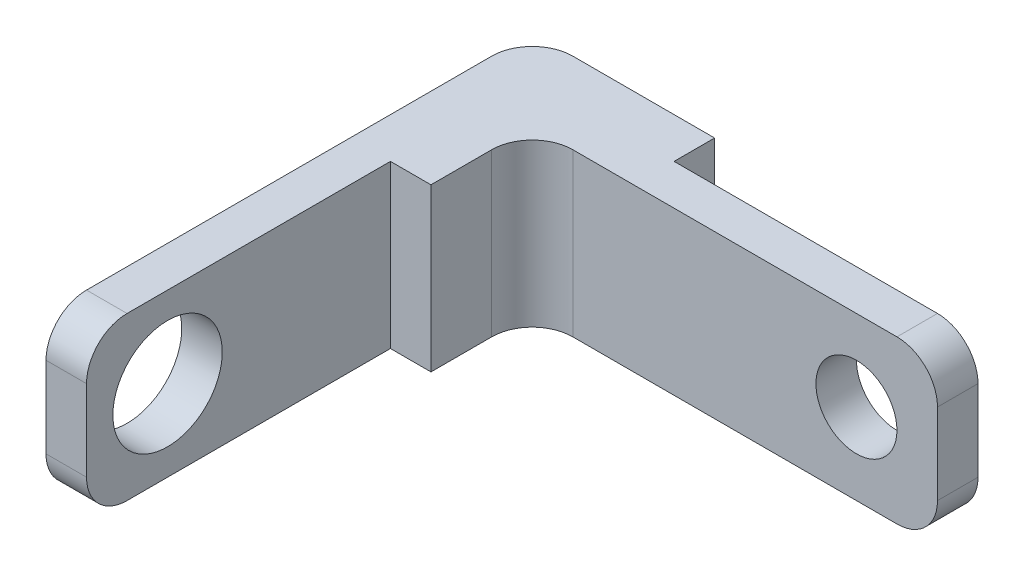
ISO-10303-21;
HEADER;
FILE_DESCRIPTION(('STEP AP214'),'2;1');
FILE_NAME('part.step','',(''),(''),'','','');
FILE_SCHEMA(('AUTOMOTIVE_DESIGN { 1 0 10303 214 1 1 1 1 }'));
ENDSEC;
DATA;
#1=APPLICATION_CONTEXT('core data for automotive mechanical design processes');
#2=APPLICATION_PROTOCOL_DEFINITION('international standard','automotive_design',2000,#1);
#3=PRODUCT_CONTEXT('',#1,'mechanical');
#4=PRODUCT('Part','Part','',(#3));
#5=PRODUCT_RELATED_PRODUCT_CATEGORY('part','',(#4));
#6=PRODUCT_DEFINITION_FORMATION('','',#4);
#7=PRODUCT_DEFINITION_CONTEXT('part definition',#1,'design');
#8=PRODUCT_DEFINITION('design','',#6,#7);
#9=PRODUCT_DEFINITION_SHAPE('','',#8);
#10=(LENGTH_UNIT() NAMED_UNIT(*) SI_UNIT(.MILLI.,.METRE.));
#11=(NAMED_UNIT(*) PLANE_ANGLE_UNIT() SI_UNIT($,.RADIAN.));
#12=(NAMED_UNIT(*) SI_UNIT($,.STERADIAN.) SOLID_ANGLE_UNIT());
#13=UNCERTAINTY_MEASURE_WITH_UNIT(LENGTH_MEASURE(1.E-05),#10,'distance_accuracy_value','');
#14=(GEOMETRIC_REPRESENTATION_CONTEXT(3) GLOBAL_UNCERTAINTY_ASSIGNED_CONTEXT((#13)) GLOBAL_UNIT_ASSIGNED_CONTEXT((#10,
#11,#12)) REPRESENTATION_CONTEXT('',''));
#15=CARTESIAN_POINT('',(0.,0.,0.));
#16=DIRECTION('',(0.,0.,1.));
#17=DIRECTION('',(1.,0.,0.));
#18=AXIS2_PLACEMENT_3D('',#15,#16,#17);
#19=CARTESIAN_POINT('',(0.,0.,120.));
#20=DIRECTION('',(0.,0.,1.));
#21=DIRECTION('',(1.,0.,0.));
#22=AXIS2_PLACEMENT_3D('',#19,#20,#21);
#23=PLANE('',#22);
#24=DIRECTION('',(0.,-1.,0.));
#25=VECTOR('',#24,1.);
#26=CARTESIAN_POINT('',(-60.,20.,120.));
#27=LINE('',#26,#25);
#28=CARTESIAN_POINT('',(-60.,10.,120.));
#29=VERTEX_POINT('',#28);
#30=CARTESIAN_POINT('',(-60.,-10.,120.));
#31=VERTEX_POINT('',#30);
#32=EDGE_CURVE('E192',#29,#31,#27,.T.);
#33=ORIENTED_EDGE('',*,*,#32,.T.);
#34=DIRECTION('',(1.,0.,0.));
#35=VECTOR('',#34,1.);
#36=CARTESIAN_POINT('',(-50.,-10.,120.));
#37=LINE('',#36,#35);
#38=CARTESIAN_POINT('',(-50.,-10.,120.));
#39=VERTEX_POINT('',#38);
#40=EDGE_CURVE('E244',#31,#39,#37,.T.);
#41=ORIENTED_EDGE('',*,*,#40,.T.);
#42=DIRECTION('',(0.,-1.,0.));
#43=VECTOR('',#42,1.);
#44=CARTESIAN_POINT('',(-50.,20.,120.));
#45=LINE('',#44,#43);
#46=CARTESIAN_POINT('',(-50.,10.,120.));
#47=VERTEX_POINT('',#46);
#48=EDGE_CURVE('E155',#47,#39,#45,.T.);
#49=ORIENTED_EDGE('',*,*,#48,.F.);
#50=DIRECTION('',(-1.,0.,0.));
#51=VECTOR('',#50,1.);
#52=CARTESIAN_POINT('',(-60.,10.,120.));
#53=LINE('',#52,#51);
#54=EDGE_CURVE('E241',#47,#29,#53,.T.);
#55=ORIENTED_EDGE('',*,*,#54,.T.);
#56=EDGE_LOOP('',(#33,#41,#49,#55));
#57=FACE_BOUND('',#56,.T.);
#58=ADVANCED_FACE('F32',(#57),#23,.T.);
#59=CARTESIAN_POINT('',(60.,20.,20.));
#60=DIRECTION('',(-1.,0.,0.));
#61=DIRECTION('',(0.,0.,1.));
#62=AXIS2_PLACEMENT_3D('',#59,#60,#61);
#63=PLANE('',#62);
#64=DIRECTION('',(0.,-1.,0.));
#65=VECTOR('',#64,1.);
#66=CARTESIAN_POINT('',(60.,20.,10.));
#67=LINE('',#66,#65);
#68=CARTESIAN_POINT('',(60.,10.,10.));
#69=VERTEX_POINT('',#68);
#70=CARTESIAN_POINT('',(60.,-10.,10.));
#71=VERTEX_POINT('',#70);
#72=EDGE_CURVE('E176',#69,#71,#67,.T.);
#73=ORIENTED_EDGE('',*,*,#72,.F.);
#74=DIRECTION('',(0.,0.,-1.));
#75=VECTOR('',#74,1.);
#76=CARTESIAN_POINT('',(60.,10.,20.));
#77=LINE('',#76,#75);
#78=CARTESIAN_POINT('',(60.,10.,20.));
#79=VERTEX_POINT('',#78);
#80=EDGE_CURVE('E228',#69,#79,#77,.F.);
#81=ORIENTED_EDGE('',*,*,#80,.T.);
#82=DIRECTION('',(0.,1.,0.));
#83=VECTOR('',#82,1.);
#84=CARTESIAN_POINT('',(60.,20.,20.));
#85=LINE('',#84,#83);
#86=CARTESIAN_POINT('',(60.,-10.,20.));
#87=VERTEX_POINT('',#86);
#88=EDGE_CURVE('E198',#87,#79,#85,.T.);
#89=ORIENTED_EDGE('',*,*,#88,.F.);
#90=DIRECTION('',(0.,0.,-1.));
#91=VECTOR('',#90,1.);
#92=CARTESIAN_POINT('',(60.,-10.,20.));
#93=LINE('',#92,#91);
#94=EDGE_CURVE('E225',#87,#71,#93,.T.);
#95=ORIENTED_EDGE('',*,*,#94,.T.);
#96=EDGE_LOOP('',(#73,#81,#89,#95));
#97=FACE_BOUND('',#96,.T.);
#98=ADVANCED_FACE('F345',(#97),#63,.F.);
#99=CARTESIAN_POINT('',(-60.,20.,20.));
#100=DIRECTION('',(0.,-1.,0.));
#101=DIRECTION('',(0.,0.,-1.));
#102=AXIS2_PLACEMENT_3D('',#99,#100,#101);
#103=PLANE('',#102);
#104=DIRECTION('',(-1.,0.,0.));
#105=VECTOR('',#104,1.);
#106=CARTESIAN_POINT('',(-60.,20.,20.));
#107=LINE('',#106,#105);
#108=CARTESIAN_POINT('',(50.,20.,20.));
#109=VERTEX_POINT('',#108);
#110=CARTESIAN_POINT('',(-30.,20.,20.));
#111=VERTEX_POINT('',#110);
#112=EDGE_CURVE('E201',#109,#111,#107,.T.);
#113=ORIENTED_EDGE('',*,*,#112,.F.);
#114=DIRECTION('',(0.,0.,-1.));
#115=VECTOR('',#114,1.);
#116=CARTESIAN_POINT('',(50.,20.,20.));
#117=LINE('',#116,#115);
#118=CARTESIAN_POINT('',(50.,20.,10.));
#119=VERTEX_POINT('',#118);
#120=EDGE_CURVE('E218',#109,#119,#117,.T.);
#121=ORIENTED_EDGE('',*,*,#120,.T.);
#122=DIRECTION('',(1.,0.,0.));
#123=VECTOR('',#122,1.);
#124=CARTESIAN_POINT('',(60.,20.,10.));
#125=LINE('',#124,#123);
#126=CARTESIAN_POINT('',(-15.,20.,10.));
#127=VERTEX_POINT('',#126);
#128=EDGE_CURVE('E184',#127,#119,#125,.T.);
#129=ORIENTED_EDGE('',*,*,#128,.F.);
#130=DIRECTION('',(0.,0.,-1.));
#131=VECTOR('',#130,1.);
#132=CARTESIAN_POINT('',(-15.,20.,10.));
#133=LINE('',#132,#131);
#134=CARTESIAN_POINT('',(-15.,20.,0.));
#135=VERTEX_POINT('',#134);
#136=EDGE_CURVE('E189',#127,#135,#133,.T.);
#137=ORIENTED_EDGE('',*,*,#136,.T.);
#138=DIRECTION('',(-1.,0.,0.));
#139=VECTOR('',#138,1.);
#140=CARTESIAN_POINT('',(-60.,20.,0.));
#141=LINE('',#140,#139);
#142=CARTESIAN_POINT('',(-50.,20.,0.));
#143=VERTEX_POINT('',#142);
#144=EDGE_CURVE('E274',#135,#143,#141,.T.);
#145=ORIENTED_EDGE('',*,*,#144,.T.);
#146=CARTESIAN_POINT('',(-50.,20.,10.));
#147=DIRECTION('',(0.,-1.,0.));
#148=DIRECTION('',(0.,0.,-1.));
#149=AXIS2_PLACEMENT_3D('',#146,#147,#148);
#150=CIRCLE('',#149,10.);
#151=CARTESIAN_POINT('',(-60.,20.,10.));
#152=VERTEX_POINT('',#151);
#153=EDGE_CURVE('E213',#143,#152,#150,.F.);
#154=ORIENTED_EDGE('',*,*,#153,.T.);
#155=DIRECTION('',(0.,0.,-1.));
#156=VECTOR('',#155,1.);
#157=CARTESIAN_POINT('',(-60.,20.,20.));
#158=LINE('',#157,#156);
#159=CARTESIAN_POINT('',(-60.,20.,110.));
#160=VERTEX_POINT('',#159);
#161=EDGE_CURVE('E216',#160,#152,#158,.T.);
#162=ORIENTED_EDGE('',*,*,#161,.F.);
#163=DIRECTION('',(-1.,0.,0.));
#164=VECTOR('',#163,1.);
#165=CARTESIAN_POINT('',(-50.,20.,110.));
#166=LINE('',#165,#164);
#167=CARTESIAN_POINT('',(-50.,20.,110.));
#168=VERTEX_POINT('',#167);
#169=EDGE_CURVE('E215',#160,#168,#166,.F.);
#170=ORIENTED_EDGE('',*,*,#169,.T.);
#171=DIRECTION('',(0.,0.,1.));
#172=VECTOR('',#171,1.);
#173=CARTESIAN_POINT('',(-50.,20.,120.));
#174=LINE('',#173,#172);
#175=CARTESIAN_POINT('',(-50.,20.,45.));
#176=VERTEX_POINT('',#175);
#177=EDGE_CURVE('E163',#176,#168,#174,.T.);
#178=ORIENTED_EDGE('',*,*,#177,.F.);
#179=DIRECTION('',(1.,0.,0.));
#180=VECTOR('',#179,1.);
#181=CARTESIAN_POINT('',(-50.,20.,45.));
#182=LINE('',#181,#180);
#183=CARTESIAN_POINT('',(-40.,20.,45.));
#184=VERTEX_POINT('',#183);
#185=EDGE_CURVE('E162',#176,#184,#182,.T.);
#186=ORIENTED_EDGE('',*,*,#185,.T.);
#187=DIRECTION('',(0.,0.,-1.));
#188=VECTOR('',#187,1.);
#189=CARTESIAN_POINT('',(-40.,20.,120.));
#190=LINE('',#189,#188);
#191=CARTESIAN_POINT('',(-40.,20.,30.));
#192=VERTEX_POINT('',#191);
#193=EDGE_CURVE('E197',#184,#192,#190,.T.);
#194=ORIENTED_EDGE('',*,*,#193,.T.);
#195=CARTESIAN_POINT('',(-30.,20.,30.));
#196=DIRECTION('',(0.,-1.,0.));
#197=DIRECTION('',(0.,0.,-1.));
#198=AXIS2_PLACEMENT_3D('',#195,#196,#197);
#199=CIRCLE('',#198,10.);
#200=EDGE_CURVE('E40',#192,#111,#199,.T.);
#201=ORIENTED_EDGE('',*,*,#200,.T.);
#202=EDGE_LOOP('',(#113,#121,#129,#137,#145,#154,#162,#170,#178,#186,#194,#201));
#203=FACE_BOUND('',#202,.T.);
#204=ADVANCED_FACE('F293',(#203),#103,.F.);
#205=CARTESIAN_POINT('',(-60.,20.,20.));
#206=DIRECTION('',(1.,0.,0.));
#207=DIRECTION('',(0.,1.,0.));
#208=AXIS2_PLACEMENT_3D('',#205,#206,#207);
#209=PLANE('',#208);
#210=CARTESIAN_POINT('',(-60.,0.,100.));
#211=DIRECTION('',(1.,0.,0.));
#212=DIRECTION('',(0.,1.,0.));
#213=AXIS2_PLACEMENT_3D('',#210,#211,#212);
#214=CIRCLE('',#213,13.5);
#215=CARTESIAN_POINT('',(-60.,13.5,100.));
#216=VERTEX_POINT('',#215);
#217=EDGE_CURVE('E307',#216,#216,#214,.F.);
#218=ORIENTED_EDGE('',*,*,#217,.F.);
#219=EDGE_LOOP('',(#218));
#220=FACE_BOUND('',#219,.T.);
#221=DIRECTION('',(0.,0.,-1.));
#222=VECTOR('',#221,1.);
#223=CARTESIAN_POINT('',(-60.,-20.,20.));
#224=LINE('',#223,#222);
#225=CARTESIAN_POINT('',(-60.,-20.,110.));
#226=VERTEX_POINT('',#225);
#227=CARTESIAN_POINT('',(-60.,-20.,10.));
#228=VERTEX_POINT('',#227);
#229=EDGE_CURVE('E263',#226,#228,#224,.T.);
#230=ORIENTED_EDGE('',*,*,#229,.F.);
#231=CARTESIAN_POINT('',(-60.,-10.,110.));
#232=DIRECTION('',(1.,0.,0.));
#233=DIRECTION('',(0.,1.,0.));
#234=AXIS2_PLACEMENT_3D('',#231,#232,#233);
#235=CIRCLE('',#234,10.);
#236=EDGE_CURVE('E255',#226,#31,#235,.F.);
#237=ORIENTED_EDGE('',*,*,#236,.T.);
#238=ORIENTED_EDGE('',*,*,#32,.F.);
#239=CARTESIAN_POINT('',(-60.,10.,110.));
#240=DIRECTION('',(1.,0.,0.));
#241=DIRECTION('',(0.,1.,0.));
#242=AXIS2_PLACEMENT_3D('',#239,#240,#241);
#243=CIRCLE('',#242,10.);
#244=EDGE_CURVE('E253',#29,#160,#243,.F.);
#245=ORIENTED_EDGE('',*,*,#244,.T.);
#246=ORIENTED_EDGE('',*,*,#161,.T.);
#247=DIRECTION('',(0.,-1.,0.));
#248=VECTOR('',#247,1.);
#249=CARTESIAN_POINT('',(-60.,20.,10.));
#250=LINE('',#249,#248);
#251=EDGE_CURVE('E250',#152,#228,#250,.T.);
#252=ORIENTED_EDGE('',*,*,#251,.T.);
#253=EDGE_LOOP('',(#230,#237,#238,#245,#246,#252));
#254=FACE_BOUND('',#253,.T.);
#255=ADVANCED_FACE('F296',(#220,#254),#209,.F.);
#256=CARTESIAN_POINT('',(-60.,-20.,20.));
#257=DIRECTION('',(0.,1.,0.));
#258=DIRECTION('',(0.,0.,1.));
#259=AXIS2_PLACEMENT_3D('',#256,#257,#258);
#260=PLANE('',#259);
#261=DIRECTION('',(-1.,0.,0.));
#262=VECTOR('',#261,1.);
#263=CARTESIAN_POINT('',(60.,-20.,10.));
#264=LINE('',#263,#262);
#265=CARTESIAN_POINT('',(50.,-20.,10.));
#266=VERTEX_POINT('',#265);
#267=CARTESIAN_POINT('',(-15.,-20.,10.));
#268=VERTEX_POINT('',#267);
#269=EDGE_CURVE('E179',#266,#268,#264,.T.);
#270=ORIENTED_EDGE('',*,*,#269,.F.);
#271=DIRECTION('',(0.,0.,-1.));
#272=VECTOR('',#271,1.);
#273=CARTESIAN_POINT('',(50.,-20.,20.));
#274=LINE('',#273,#272);
#275=CARTESIAN_POINT('',(50.,-20.,20.));
#276=VERTEX_POINT('',#275);
#277=EDGE_CURVE('E238',#266,#276,#274,.F.);
#278=ORIENTED_EDGE('',*,*,#277,.T.);
#279=DIRECTION('',(1.,0.,0.));
#280=VECTOR('',#279,1.);
#281=CARTESIAN_POINT('',(-60.,-20.,20.));
#282=LINE('',#281,#280);
#283=CARTESIAN_POINT('',(-30.,-20.,20.));
#284=VERTEX_POINT('',#283);
#285=EDGE_CURVE('E210',#284,#276,#282,.T.);
#286=ORIENTED_EDGE('',*,*,#285,.F.);
#287=CARTESIAN_POINT('',(-30.,-20.,30.));
#288=DIRECTION('',(0.,1.,0.));
#289=DIRECTION('',(0.,0.,1.));
#290=AXIS2_PLACEMENT_3D('',#287,#288,#289);
#291=CIRCLE('',#290,10.);
#292=CARTESIAN_POINT('',(-40.,-20.,30.));
#293=VERTEX_POINT('',#292);
#294=EDGE_CURVE('E11',#284,#293,#291,.T.);
#295=ORIENTED_EDGE('',*,*,#294,.T.);
#296=DIRECTION('',(0.,0.,-1.));
#297=VECTOR('',#296,1.);
#298=CARTESIAN_POINT('',(-40.,-20.,120.));
#299=LINE('',#298,#297);
#300=CARTESIAN_POINT('',(-40.,-20.,45.));
#301=VERTEX_POINT('',#300);
#302=EDGE_CURVE('E169',#301,#293,#299,.T.);
#303=ORIENTED_EDGE('',*,*,#302,.F.);
#304=DIRECTION('',(1.,0.,0.));
#305=VECTOR('',#304,1.);
#306=CARTESIAN_POINT('',(-50.,-20.,45.));
#307=LINE('',#306,#305);
#308=CARTESIAN_POINT('',(-50.,-20.,45.));
#309=VERTEX_POINT('',#308);
#310=EDGE_CURVE('E159',#309,#301,#307,.T.);
#311=ORIENTED_EDGE('',*,*,#310,.F.);
#312=DIRECTION('',(0.,0.,-1.));
#313=VECTOR('',#312,1.);
#314=CARTESIAN_POINT('',(-50.,-20.,120.));
#315=LINE('',#314,#313);
#316=CARTESIAN_POINT('',(-50.,-20.,110.));
#317=VERTEX_POINT('',#316);
#318=EDGE_CURVE('E144',#317,#309,#315,.T.);
#319=ORIENTED_EDGE('',*,*,#318,.F.);
#320=DIRECTION('',(1.,0.,0.));
#321=VECTOR('',#320,1.);
#322=CARTESIAN_POINT('',(-60.,-20.,110.));
#323=LINE('',#322,#321);
#324=EDGE_CURVE('E236',#317,#226,#323,.F.);
#325=ORIENTED_EDGE('',*,*,#324,.T.);
#326=ORIENTED_EDGE('',*,*,#229,.T.);
#327=CARTESIAN_POINT('',(-50.,-20.,10.));
#328=DIRECTION('',(0.,1.,0.));
#329=DIRECTION('',(0.,0.,1.));
#330=AXIS2_PLACEMENT_3D('',#327,#328,#329);
#331=CIRCLE('',#330,10.);
#332=CARTESIAN_POINT('',(-50.,-20.,0.));
#333=VERTEX_POINT('',#332);
#334=EDGE_CURVE('E234',#228,#333,#331,.F.);
#335=ORIENTED_EDGE('',*,*,#334,.T.);
#336=DIRECTION('',(1.,0.,0.));
#337=VECTOR('',#336,1.);
#338=CARTESIAN_POINT('',(-60.,-20.,0.));
#339=LINE('',#338,#337);
#340=CARTESIAN_POINT('',(-15.,-20.,0.));
#341=VERTEX_POINT('',#340);
#342=EDGE_CURVE('E202',#333,#341,#339,.T.);
#343=ORIENTED_EDGE('',*,*,#342,.T.);
#344=DIRECTION('',(0.,0.,-1.));
#345=VECTOR('',#344,1.);
#346=CARTESIAN_POINT('',(-15.,-20.,10.));
#347=LINE('',#346,#345);
#348=EDGE_CURVE('E187',#268,#341,#347,.T.);
#349=ORIENTED_EDGE('',*,*,#348,.F.);
#350=EDGE_LOOP('',(#270,#278,#286,#295,#303,#311,#319,#325,#326,#335,#343,#349));
#351=FACE_BOUND('',#350,.T.);
#352=ADVANCED_FACE('F167',(#351),#260,.F.);
#353=CARTESIAN_POINT('',(0.,0.,20.));
#354=DIRECTION('',(0.,0.,1.));
#355=DIRECTION('',(1.,0.,0.));
#356=AXIS2_PLACEMENT_3D('',#353,#354,#355);
#357=PLANE('',#356);
#358=CARTESIAN_POINT('',(40.,0.,20.));
#359=DIRECTION('',(0.,0.,1.));
#360=DIRECTION('',(1.,0.,0.));
#361=AXIS2_PLACEMENT_3D('',#358,#359,#360);
#362=CIRCLE('',#361,9.99999999999999);
#363=CARTESIAN_POINT('',(50.,0.,20.));
#364=VERTEX_POINT('',#363);
#365=EDGE_CURVE('E315',#364,#364,#362,.T.);
#366=ORIENTED_EDGE('',*,*,#365,.F.);
#367=EDGE_LOOP('',(#366));
#368=FACE_BOUND('',#367,.T.);
#369=ORIENTED_EDGE('',*,*,#112,.T.);
#370=DIRECTION('',(0.,1.,0.));
#371=VECTOR('',#370,1.);
#372=CARTESIAN_POINT('',(-30.,0.,20.));
#373=LINE('',#372,#371);
#374=EDGE_CURVE('E47',#111,#284,#373,.F.);
#375=ORIENTED_EDGE('',*,*,#374,.T.);
#376=ORIENTED_EDGE('',*,*,#285,.T.);
#377=CARTESIAN_POINT('',(50.,-10.,20.));
#378=DIRECTION('',(0.,0.,1.));
#379=DIRECTION('',(1.,0.,0.));
#380=AXIS2_PLACEMENT_3D('',#377,#378,#379);
#381=CIRCLE('',#380,10.);
#382=EDGE_CURVE('E230',#276,#87,#381,.T.);
#383=ORIENTED_EDGE('',*,*,#382,.T.);
#384=ORIENTED_EDGE('',*,*,#88,.T.);
#385=CARTESIAN_POINT('',(50.,10.,20.));
#386=DIRECTION('',(0.,0.,1.));
#387=DIRECTION('',(1.,0.,0.));
#388=AXIS2_PLACEMENT_3D('',#385,#386,#387);
#389=CIRCLE('',#388,10.);
#390=EDGE_CURVE('E232',#79,#109,#389,.T.);
#391=ORIENTED_EDGE('',*,*,#390,.T.);
#392=EDGE_LOOP('',(#369,#375,#376,#383,#384,#391));
#393=FACE_BOUND('',#392,.T.);
#394=ADVANCED_FACE('F330',(#368,#393),#357,.T.);
#395=CARTESIAN_POINT('',(0.,0.,0.));
#396=DIRECTION('',(0.,0.,1.));
#397=DIRECTION('',(1.,0.,0.));
#398=AXIS2_PLACEMENT_3D('',#395,#396,#397);
#399=PLANE('',#398);
#400=ORIENTED_EDGE('',*,*,#342,.F.);
#401=DIRECTION('',(0.,-1.,0.));
#402=VECTOR('',#401,1.);
#403=CARTESIAN_POINT('',(-50.,0.,0.));
#404=LINE('',#403,#402);
#405=EDGE_CURVE('E257',#333,#143,#404,.F.);
#406=ORIENTED_EDGE('',*,*,#405,.T.);
#407=ORIENTED_EDGE('',*,*,#144,.F.);
#408=DIRECTION('',(0.,1.,0.));
#409=VECTOR('',#408,1.);
#410=CARTESIAN_POINT('',(-15.,20.,0.));
#411=LINE('',#410,#409);
#412=EDGE_CURVE('E171',#341,#135,#411,.T.);
#413=ORIENTED_EDGE('',*,*,#412,.F.);
#414=EDGE_LOOP('',(#400,#406,#407,#413));
#415=FACE_BOUND('',#414,.T.);
#416=ADVANCED_FACE('F288',(#415),#399,.F.);
#417=CARTESIAN_POINT('',(-40.,20.,120.));
#418=DIRECTION('',(-1.,0.,0.));
#419=DIRECTION('',(0.,0.,1.));
#420=AXIS2_PLACEMENT_3D('',#417,#418,#419);
#421=PLANE('',#420);
#422=ORIENTED_EDGE('',*,*,#302,.T.);
#423=DIRECTION('',(0.,1.,0.));
#424=VECTOR('',#423,1.);
#425=CARTESIAN_POINT('',(-40.,20.,30.));
#426=LINE('',#425,#424);
#427=EDGE_CURVE('E259',#293,#192,#426,.T.);
#428=ORIENTED_EDGE('',*,*,#427,.T.);
#429=ORIENTED_EDGE('',*,*,#193,.F.);
#430=DIRECTION('',(0.,1.,0.));
#431=VECTOR('',#430,1.);
#432=CARTESIAN_POINT('',(-40.,20.,45.));
#433=LINE('',#432,#431);
#434=EDGE_CURVE('E305',#301,#184,#433,.T.);
#435=ORIENTED_EDGE('',*,*,#434,.F.);
#436=EDGE_LOOP('',(#422,#428,#429,#435));
#437=FACE_BOUND('',#436,.T.);
#438=ADVANCED_FACE('F357',(#437),#421,.F.);
#439=CARTESIAN_POINT('',(-15.,20.,10.));
#440=DIRECTION('',(-1.,0.,0.));
#441=DIRECTION('',(0.,-1.,0.));
#442=AXIS2_PLACEMENT_3D('',#439,#440,#441);
#443=PLANE('',#442);
#444=ORIENTED_EDGE('',*,*,#412,.T.);
#445=ORIENTED_EDGE('',*,*,#136,.F.);
#446=DIRECTION('',(0.,1.,0.));
#447=VECTOR('',#446,1.);
#448=CARTESIAN_POINT('',(-15.,20.,10.));
#449=LINE('',#448,#447);
#450=EDGE_CURVE('E181',#268,#127,#449,.T.);
#451=ORIENTED_EDGE('',*,*,#450,.F.);
#452=ORIENTED_EDGE('',*,*,#348,.T.);
#453=EDGE_LOOP('',(#444,#445,#451,#452));
#454=FACE_BOUND('',#453,.T.);
#455=ADVANCED_FACE('F287',(#454),#443,.F.);
#456=CARTESIAN_POINT('',(0.,0.,10.));
#457=DIRECTION('',(0.,0.,-1.));
#458=DIRECTION('',(-1.,0.,0.));
#459=AXIS2_PLACEMENT_3D('',#456,#457,#458);
#460=PLANE('',#459);
#461=CARTESIAN_POINT('',(40.,0.,10.));
#462=DIRECTION('',(0.,0.,1.));
#463=DIRECTION('',(1.,0.,0.));
#464=AXIS2_PLACEMENT_3D('',#461,#462,#463);
#465=CIRCLE('',#464,9.99999999999999);
#466=CARTESIAN_POINT('',(50.,0.,10.));
#467=VERTEX_POINT('',#466);
#468=EDGE_CURVE('E314',#467,#467,#465,.T.);
#469=ORIENTED_EDGE('',*,*,#468,.T.);
#470=EDGE_LOOP('',(#469));
#471=FACE_BOUND('',#470,.T.);
#472=ORIENTED_EDGE('',*,*,#128,.T.);
#473=CARTESIAN_POINT('',(50.,10.,10.));
#474=DIRECTION('',(0.,0.,-1.));
#475=DIRECTION('',(-1.,0.,0.));
#476=AXIS2_PLACEMENT_3D('',#473,#474,#475);
#477=CIRCLE('',#476,10.);
#478=EDGE_CURVE('E223',#119,#69,#477,.T.);
#479=ORIENTED_EDGE('',*,*,#478,.T.);
#480=ORIENTED_EDGE('',*,*,#72,.T.);
#481=CARTESIAN_POINT('',(50.,-10.,10.));
#482=DIRECTION('',(0.,0.,-1.));
#483=DIRECTION('',(-1.,0.,0.));
#484=AXIS2_PLACEMENT_3D('',#481,#482,#483);
#485=CIRCLE('',#484,10.);
#486=EDGE_CURVE('E221',#71,#266,#485,.T.);
#487=ORIENTED_EDGE('',*,*,#486,.T.);
#488=ORIENTED_EDGE('',*,*,#269,.T.);
#489=ORIENTED_EDGE('',*,*,#450,.T.);
#490=EDGE_LOOP('',(#472,#479,#480,#487,#488,#489));
#491=FACE_BOUND('',#490,.T.);
#492=ADVANCED_FACE('F321',(#471,#491),#460,.T.);
#493=CARTESIAN_POINT('',(-50.,20.,45.));
#494=DIRECTION('',(0.,0.,-1.));
#495=DIRECTION('',(-1.,0.,0.));
#496=AXIS2_PLACEMENT_3D('',#493,#494,#495);
#497=PLANE('',#496);
#498=ORIENTED_EDGE('',*,*,#434,.T.);
#499=ORIENTED_EDGE('',*,*,#185,.F.);
#500=DIRECTION('',(0.,1.,0.));
#501=VECTOR('',#500,1.);
#502=CARTESIAN_POINT('',(-50.,20.,45.));
#503=LINE('',#502,#501);
#504=EDGE_CURVE('E149',#309,#176,#503,.T.);
#505=ORIENTED_EDGE('',*,*,#504,.F.);
#506=ORIENTED_EDGE('',*,*,#310,.T.);
#507=EDGE_LOOP('',(#498,#499,#505,#506));
#508=FACE_BOUND('',#507,.T.);
#509=ADVANCED_FACE('F158',(#508),#497,.F.);
#510=CARTESIAN_POINT('',(-50.,0.,0.));
#511=DIRECTION('',(1.,0.,0.));
#512=DIRECTION('',(0.,0.,-1.));
#513=AXIS2_PLACEMENT_3D('',#510,#511,#512);
#514=PLANE('',#513);
#515=CARTESIAN_POINT('',(-50.,0.,100.));
#516=DIRECTION('',(1.,0.,0.));
#517=DIRECTION('',(0.,1.,0.));
#518=AXIS2_PLACEMENT_3D('',#515,#516,#517);
#519=CIRCLE('',#518,13.5);
#520=CARTESIAN_POINT('',(-50.,13.5,100.));
#521=VERTEX_POINT('',#520);
#522=EDGE_CURVE('E311',#521,#521,#519,.T.);
#523=ORIENTED_EDGE('',*,*,#522,.F.);
#524=EDGE_LOOP('',(#523));
#525=FACE_BOUND('',#524,.T.);
#526=ORIENTED_EDGE('',*,*,#48,.T.);
#527=CARTESIAN_POINT('',(-50.,-10.,110.));
#528=DIRECTION('',(1.,0.,0.));
#529=DIRECTION('',(0.,0.,-1.));
#530=AXIS2_PLACEMENT_3D('',#527,#528,#529);
#531=CIRCLE('',#530,10.);
#532=EDGE_CURVE('E151',#39,#317,#531,.T.);
#533=ORIENTED_EDGE('',*,*,#532,.T.);
#534=ORIENTED_EDGE('',*,*,#318,.T.);
#535=ORIENTED_EDGE('',*,*,#504,.T.);
#536=ORIENTED_EDGE('',*,*,#177,.T.);
#537=CARTESIAN_POINT('',(-50.,10.,110.));
#538=DIRECTION('',(1.,0.,0.));
#539=DIRECTION('',(0.,0.,-1.));
#540=AXIS2_PLACEMENT_3D('',#537,#538,#539);
#541=CIRCLE('',#540,10.);
#542=EDGE_CURVE('E247',#168,#47,#541,.T.);
#543=ORIENTED_EDGE('',*,*,#542,.T.);
#544=EDGE_LOOP('',(#526,#533,#534,#535,#536,#543));
#545=FACE_BOUND('',#544,.T.);
#546=ADVANCED_FACE('F147',(#525,#545),#514,.T.);
#547=CARTESIAN_POINT('',(-60.001,0.,100.));
#548=DIRECTION('',(1.,0.,0.));
#549=DIRECTION('',(0.,1.,0.));
#550=AXIS2_PLACEMENT_3D('',#547,#548,#549);
#551=CYLINDRICAL_SURFACE('',#550,13.5);
#552=ORIENTED_EDGE('',*,*,#522,.T.);
#553=EDGE_LOOP('',(#552));
#554=FACE_BOUND('',#553,.T.);
#555=ORIENTED_EDGE('',*,*,#217,.T.);
#556=EDGE_LOOP('',(#555));
#557=FACE_BOUND('',#556,.T.);
#558=ADVANCED_FACE('F379',(#554,#557),#551,.F.);
#559=CARTESIAN_POINT('',(50.,10.,20.));
#560=DIRECTION('',(0.,0.,-1.));
#561=DIRECTION('',(-1.,0.,0.));
#562=AXIS2_PLACEMENT_3D('',#559,#560,#561);
#563=CYLINDRICAL_SURFACE('',#562,10.);
#564=ORIENTED_EDGE('',*,*,#390,.F.);
#565=ORIENTED_EDGE('',*,*,#80,.F.);
#566=ORIENTED_EDGE('',*,*,#478,.F.);
#567=ORIENTED_EDGE('',*,*,#120,.F.);
#568=EDGE_LOOP('',(#564,#565,#566,#567));
#569=FACE_BOUND('',#568,.T.);
#570=ADVANCED_FACE('F348',(#569),#563,.T.);
#571=CARTESIAN_POINT('',(50.,-10.,20.));
#572=DIRECTION('',(0.,0.,-1.));
#573=DIRECTION('',(-1.,0.,0.));
#574=AXIS2_PLACEMENT_3D('',#571,#572,#573);
#575=CYLINDRICAL_SURFACE('',#574,10.);
#576=ORIENTED_EDGE('',*,*,#382,.F.);
#577=ORIENTED_EDGE('',*,*,#277,.F.);
#578=ORIENTED_EDGE('',*,*,#486,.F.);
#579=ORIENTED_EDGE('',*,*,#94,.F.);
#580=EDGE_LOOP('',(#576,#577,#578,#579));
#581=FACE_BOUND('',#580,.T.);
#582=ADVANCED_FACE('F341',(#581),#575,.T.);
#583=CARTESIAN_POINT('',(0.,-10.,110.));
#584=DIRECTION('',(-1.,0.,0.));
#585=DIRECTION('',(0.,0.,1.));
#586=AXIS2_PLACEMENT_3D('',#583,#584,#585);
#587=CYLINDRICAL_SURFACE('',#586,10.);
#588=ORIENTED_EDGE('',*,*,#236,.F.);
#589=ORIENTED_EDGE('',*,*,#324,.F.);
#590=ORIENTED_EDGE('',*,*,#532,.F.);
#591=ORIENTED_EDGE('',*,*,#40,.F.);
#592=EDGE_LOOP('',(#588,#589,#590,#591));
#593=FACE_BOUND('',#592,.T.);
#594=ADVANCED_FACE('F382',(#593),#587,.T.);
#595=CARTESIAN_POINT('',(0.,10.,110.));
#596=DIRECTION('',(1.,0.,0.));
#597=DIRECTION('',(0.,0.,-1.));
#598=AXIS2_PLACEMENT_3D('',#595,#596,#597);
#599=CYLINDRICAL_SURFACE('',#598,10.);
#600=ORIENTED_EDGE('',*,*,#542,.F.);
#601=ORIENTED_EDGE('',*,*,#169,.F.);
#602=ORIENTED_EDGE('',*,*,#244,.F.);
#603=ORIENTED_EDGE('',*,*,#54,.F.);
#604=EDGE_LOOP('',(#600,#601,#602,#603));
#605=FACE_BOUND('',#604,.T.);
#606=ADVANCED_FACE('F301',(#605),#599,.T.);
#607=CARTESIAN_POINT('',(-50.,20.,10.));
#608=DIRECTION('',(0.,-1.,0.));
#609=DIRECTION('',(1.,0.,0.));
#610=AXIS2_PLACEMENT_3D('',#607,#608,#609);
#611=CYLINDRICAL_SURFACE('',#610,10.);
#612=ORIENTED_EDGE('',*,*,#153,.F.);
#613=ORIENTED_EDGE('',*,*,#405,.F.);
#614=ORIENTED_EDGE('',*,*,#334,.F.);
#615=ORIENTED_EDGE('',*,*,#251,.F.);
#616=EDGE_LOOP('',(#612,#613,#614,#615));
#617=FACE_BOUND('',#616,.T.);
#618=ADVANCED_FACE('F290',(#617),#611,.T.);
#619=CARTESIAN_POINT('',(40.,0.,10.));
#620=DIRECTION('',(0.,0.,1.));
#621=DIRECTION('',(1.,0.,0.));
#622=AXIS2_PLACEMENT_3D('',#619,#620,#621);
#623=CYLINDRICAL_SURFACE('',#622,9.99999999999999);
#624=ORIENTED_EDGE('',*,*,#468,.F.);
#625=EDGE_LOOP('',(#624));
#626=FACE_BOUND('',#625,.T.);
#627=ORIENTED_EDGE('',*,*,#365,.T.);
#628=EDGE_LOOP('',(#627));
#629=FACE_BOUND('',#628,.T.);
#630=ADVANCED_FACE('F324',(#626,#629),#623,.F.);
#631=CARTESIAN_POINT('',(-30.,20.,30.));
#632=DIRECTION('',(0.,1.,0.));
#633=DIRECTION('',(0.,0.,1.));
#634=AXIS2_PLACEMENT_3D('',#631,#632,#633);
#635=CYLINDRICAL_SURFACE('',#634,10.);
#636=ORIENTED_EDGE('',*,*,#294,.F.);
#637=ORIENTED_EDGE('',*,*,#374,.F.);
#638=ORIENTED_EDGE('',*,*,#200,.F.);
#639=ORIENTED_EDGE('',*,*,#427,.F.);
#640=EDGE_LOOP('',(#636,#637,#638,#639));
#641=FACE_BOUND('',#640,.T.);
#642=ADVANCED_FACE('F34',(#641),#635,.F.);
#643=CLOSED_SHELL('',(#58,#98,#204,#255,#352,#394,#416,#438,#455,#492,#509,#546,#558,#570,#582,
#594,#606,#618,#630,#642));
#644=MANIFOLD_SOLID_BREP('B2',#643);
#645=ADVANCED_BREP_SHAPE_REPRESENTATION('',(#18,#644),#14);
#646=SHAPE_DEFINITION_REPRESENTATION(#9,#645);
ENDSEC;
END-ISO-10303-21;
